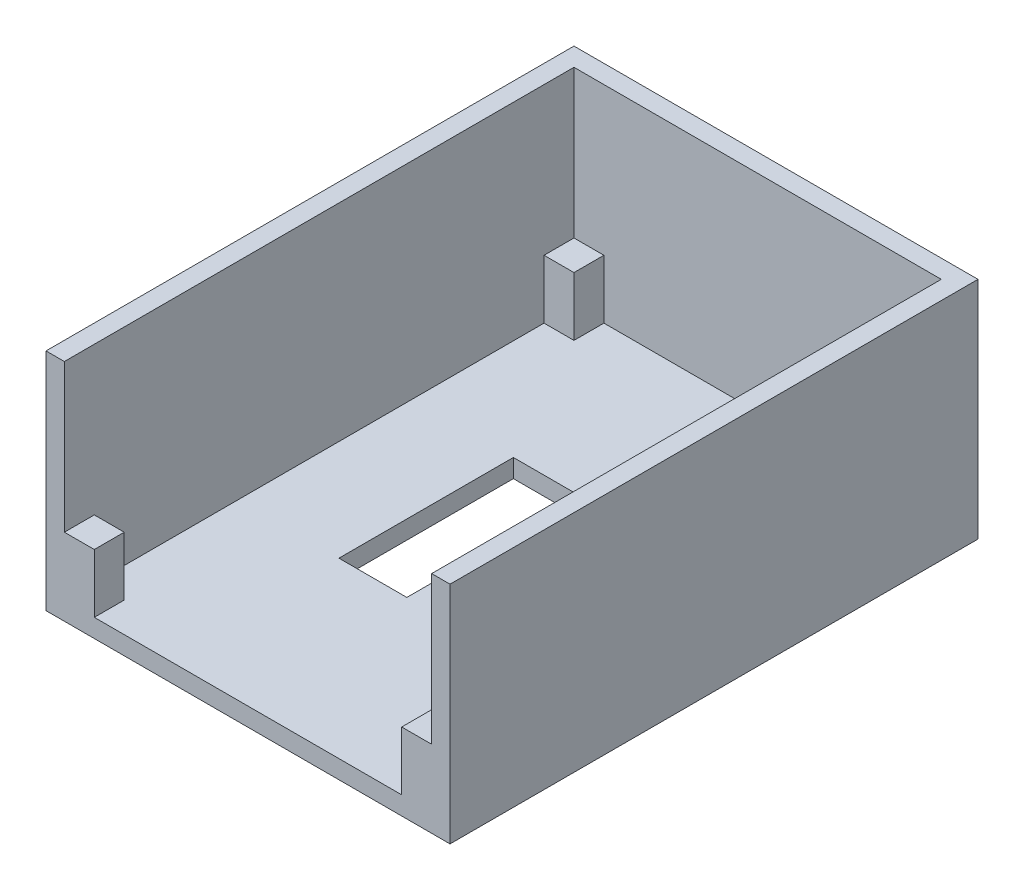
ISO-10303-21;
HEADER;
FILE_DESCRIPTION(('STEP AP214'),'2;1');
FILE_NAME('part.step','',(''),(''),'','','');
FILE_SCHEMA(('AUTOMOTIVE_DESIGN { 1 0 10303 214 1 1 1 1 }'));
ENDSEC;
DATA;
#1=APPLICATION_CONTEXT('core data for automotive mechanical design processes');
#2=APPLICATION_PROTOCOL_DEFINITION('international standard','automotive_design',2000,#1);
#3=PRODUCT_CONTEXT('',#1,'mechanical');
#4=PRODUCT('Part','Part','',(#3));
#5=PRODUCT_RELATED_PRODUCT_CATEGORY('part','',(#4));
#6=PRODUCT_DEFINITION_FORMATION('','',#4);
#7=PRODUCT_DEFINITION_CONTEXT('part definition',#1,'design');
#8=PRODUCT_DEFINITION('design','',#6,#7);
#9=PRODUCT_DEFINITION_SHAPE('','',#8);
#10=(LENGTH_UNIT() NAMED_UNIT(*) SI_UNIT(.MILLI.,.METRE.));
#11=(NAMED_UNIT(*) PLANE_ANGLE_UNIT() SI_UNIT($,.RADIAN.));
#12=(NAMED_UNIT(*) SI_UNIT($,.STERADIAN.) SOLID_ANGLE_UNIT());
#13=UNCERTAINTY_MEASURE_WITH_UNIT(LENGTH_MEASURE(1.E-05),#10,'distance_accuracy_value','');
#14=(GEOMETRIC_REPRESENTATION_CONTEXT(3) GLOBAL_UNCERTAINTY_ASSIGNED_CONTEXT((#13)) GLOBAL_UNIT_ASSIGNED_CONTEXT((#10,
#11,#12)) REPRESENTATION_CONTEXT('',''));
#15=CARTESIAN_POINT('',(0.,0.,0.));
#16=DIRECTION('',(0.,0.,1.));
#17=DIRECTION('',(1.,0.,0.));
#18=AXIS2_PLACEMENT_3D('',#15,#16,#17);
#19=CARTESIAN_POINT('',(0.,2.54,0.));
#20=DIRECTION('',(0.,1.,0.));
#21=DIRECTION('',(0.,0.,1.));
#22=AXIS2_PLACEMENT_3D('',#19,#20,#21);
#23=PLANE('',#22);
#24=DIRECTION('',(0.,0.,1.));
#25=VECTOR('',#24,1.);
#26=CARTESIAN_POINT('',(-11.43,2.54,-12.8905));
#27=LINE('',#26,#25);
#28=CARTESIAN_POINT('',(-11.43,2.54,-12.8905));
#29=VERTEX_POINT('',#28);
#30=CARTESIAN_POINT('',(-11.43,2.54,11.2395));
#31=VERTEX_POINT('',#30);
#32=EDGE_CURVE('E56',#29,#31,#27,.T.);
#33=ORIENTED_EDGE('',*,*,#32,.F.);
#34=DIRECTION('',(-1.,0.,0.));
#35=VECTOR('',#34,1.);
#36=CARTESIAN_POINT('',(-11.43,2.54,-12.8905));
#37=LINE('',#36,#35);
#38=CARTESIAN_POINT('',(-2.032,2.54,-12.8905));
#39=VERTEX_POINT('',#38);
#40=EDGE_CURVE('E222',#39,#29,#37,.T.);
#41=ORIENTED_EDGE('',*,*,#40,.F.);
#42=DIRECTION('',(0.,0.,-1.));
#43=VECTOR('',#42,1.);
#44=CARTESIAN_POINT('',(-2.032,2.54,-12.8905));
#45=LINE('',#44,#43);
#46=CARTESIAN_POINT('',(-2.032,2.54,11.2395));
#47=VERTEX_POINT('',#46);
#48=EDGE_CURVE('E226',#47,#39,#45,.T.);
#49=ORIENTED_EDGE('',*,*,#48,.F.);
#50=DIRECTION('',(1.,0.,0.));
#51=VECTOR('',#50,1.);
#52=CARTESIAN_POINT('',(-11.43,2.54,11.2395));
#53=LINE('',#52,#51);
#54=EDGE_CURVE('E235',#31,#47,#53,.T.);
#55=ORIENTED_EDGE('',*,*,#54,.F.);
#56=EDGE_LOOP('',(#33,#41,#49,#55));
#57=FACE_BOUND('',#56,.T.);
#58=DIRECTION('',(-1.,0.,0.));
#59=VECTOR('',#58,1.);
#60=CARTESIAN_POINT('',(-25.4,2.54,31.1023));
#61=LINE('',#60,#59);
#62=CARTESIAN_POINT('',(-21.2598,2.54,31.1023));
#63=VERTEX_POINT('',#62);
#64=CARTESIAN_POINT('',(-25.4,2.54,31.1023));
#65=VERTEX_POINT('',#64);
#66=EDGE_CURVE('E255',#63,#65,#61,.T.);
#67=ORIENTED_EDGE('',*,*,#66,.F.);
#68=DIRECTION('',(0.,0.,-1.));
#69=VECTOR('',#68,1.);
#70=CARTESIAN_POINT('',(-21.2598,2.54,35.2425));
#71=LINE('',#70,#69);
#72=CARTESIAN_POINT('',(-21.2598,2.54,35.2425));
#73=VERTEX_POINT('',#72);
#74=EDGE_CURVE('E244',#73,#63,#71,.T.);
#75=ORIENTED_EDGE('',*,*,#74,.F.);
#76=DIRECTION('',(1.,0.,0.));
#77=VECTOR('',#76,1.);
#78=CARTESIAN_POINT('',(25.4,2.54,35.2425));
#79=LINE('',#78,#77);
#80=CARTESIAN_POINT('',(21.2598,2.54,35.2425));
#81=VERTEX_POINT('',#80);
#82=EDGE_CURVE('E452',#73,#81,#79,.T.);
#83=ORIENTED_EDGE('',*,*,#82,.T.);
#84=DIRECTION('',(0.,0.,1.));
#85=VECTOR('',#84,1.);
#86=CARTESIAN_POINT('',(21.2598,2.54,35.2425));
#87=LINE('',#86,#85);
#88=CARTESIAN_POINT('',(21.2598,2.54,31.1023));
#89=VERTEX_POINT('',#88);
#90=EDGE_CURVE('E288',#89,#81,#87,.T.);
#91=ORIENTED_EDGE('',*,*,#90,.F.);
#92=DIRECTION('',(-1.,0.,0.));
#93=VECTOR('',#92,1.);
#94=CARTESIAN_POINT('',(25.4,2.54,31.1023));
#95=LINE('',#94,#93);
#96=CARTESIAN_POINT('',(25.4,2.54,31.1023));
#97=VERTEX_POINT('',#96);
#98=EDGE_CURVE('E282',#97,#89,#95,.T.);
#99=ORIENTED_EDGE('',*,*,#98,.F.);
#100=DIRECTION('',(0.,0.,-1.));
#101=VECTOR('',#100,1.);
#102=CARTESIAN_POINT('',(25.4,2.54,35.2425));
#103=LINE('',#102,#101);
#104=CARTESIAN_POINT('',(25.4,2.54,-31.1023));
#105=VERTEX_POINT('',#104);
#106=EDGE_CURVE('E49',#97,#105,#103,.T.);
#107=ORIENTED_EDGE('',*,*,#106,.T.);
#108=DIRECTION('',(1.,0.,0.));
#109=VECTOR('',#108,1.);
#110=CARTESIAN_POINT('',(25.4,2.54,-31.1023));
#111=LINE('',#110,#109);
#112=CARTESIAN_POINT('',(21.2598,2.54,-31.1023));
#113=VERTEX_POINT('',#112);
#114=EDGE_CURVE('E322',#113,#105,#111,.T.);
#115=ORIENTED_EDGE('',*,*,#114,.F.);
#116=DIRECTION('',(0.,0.,1.));
#117=VECTOR('',#116,1.);
#118=CARTESIAN_POINT('',(21.2598,2.54,-35.2425));
#119=LINE('',#118,#117);
#120=CARTESIAN_POINT('',(21.2598,2.54,-35.2425));
#121=VERTEX_POINT('',#120);
#122=EDGE_CURVE('E316',#121,#113,#119,.T.);
#123=ORIENTED_EDGE('',*,*,#122,.F.);
#124=DIRECTION('',(-1.,0.,0.));
#125=VECTOR('',#124,1.);
#126=CARTESIAN_POINT('',(25.4,2.54,-35.2425));
#127=LINE('',#126,#125);
#128=CARTESIAN_POINT('',(-21.2598,2.54,-35.2425));
#129=VERTEX_POINT('',#128);
#130=EDGE_CURVE('E11',#121,#129,#127,.T.);
#131=ORIENTED_EDGE('',*,*,#130,.T.);
#132=DIRECTION('',(0.,0.,-1.));
#133=VECTOR('',#132,1.);
#134=CARTESIAN_POINT('',(-21.2598,2.54,-35.2425));
#135=LINE('',#134,#133);
#136=CARTESIAN_POINT('',(-21.2598,2.54,-31.1023));
#137=VERTEX_POINT('',#136);
#138=EDGE_CURVE('E357',#137,#129,#135,.T.);
#139=ORIENTED_EDGE('',*,*,#138,.F.);
#140=DIRECTION('',(1.,0.,0.));
#141=VECTOR('',#140,1.);
#142=CARTESIAN_POINT('',(-25.4,2.54,-31.1023));
#143=LINE('',#142,#141);
#144=CARTESIAN_POINT('',(-25.4,2.54,-31.1023));
#145=VERTEX_POINT('',#144);
#146=EDGE_CURVE('E351',#145,#137,#143,.T.);
#147=ORIENTED_EDGE('',*,*,#146,.F.);
#148=DIRECTION('',(0.,0.,1.));
#149=VECTOR('',#148,1.);
#150=CARTESIAN_POINT('',(-25.4,2.54,35.2425));
#151=LINE('',#150,#149);
#152=EDGE_CURVE('E448',#145,#65,#151,.T.);
#153=ORIENTED_EDGE('',*,*,#152,.T.);
#154=EDGE_LOOP('',(#67,#75,#83,#91,#99,#107,#115,#123,#131,#139,#147,#153));
#155=FACE_BOUND('',#154,.T.);
#156=ADVANCED_FACE('F39',(#57,#155),#23,.T.);
#157=CARTESIAN_POINT('',(-25.4,31.115,35.2425));
#158=DIRECTION('',(-1.,0.,0.));
#159=DIRECTION('',(0.,0.,1.));
#160=AXIS2_PLACEMENT_3D('',#157,#158,#159);
#161=PLANE('',#160);
#162=DIRECTION('',(0.,-1.,0.));
#163=VECTOR('',#162,1.);
#164=CARTESIAN_POINT('',(-25.4,10.668,31.1023));
#165=LINE('',#164,#163);
#166=CARTESIAN_POINT('',(-25.4,10.668,31.1023));
#167=VERTEX_POINT('',#166);
#168=EDGE_CURVE('E265',#167,#65,#165,.T.);
#169=ORIENTED_EDGE('',*,*,#168,.T.);
#170=ORIENTED_EDGE('',*,*,#152,.F.);
#171=DIRECTION('',(0.,-1.,0.));
#172=VECTOR('',#171,1.);
#173=CARTESIAN_POINT('',(-25.4,10.668,-31.1023));
#174=LINE('',#173,#172);
#175=CARTESIAN_POINT('',(-25.4,10.668,-31.1023));
#176=VERTEX_POINT('',#175);
#177=EDGE_CURVE('E380',#176,#145,#174,.T.);
#178=ORIENTED_EDGE('',*,*,#177,.F.);
#179=DIRECTION('',(0.,0.,1.));
#180=VECTOR('',#179,1.);
#181=CARTESIAN_POINT('',(-25.4,10.668,-35.2425));
#182=LINE('',#181,#180);
#183=CARTESIAN_POINT('',(-25.4,10.668,-35.2425));
#184=VERTEX_POINT('',#183);
#185=EDGE_CURVE('E352',#184,#176,#182,.T.);
#186=ORIENTED_EDGE('',*,*,#185,.F.);
#187=DIRECTION('',(0.,-1.,0.));
#188=VECTOR('',#187,1.);
#189=CARTESIAN_POINT('',(-25.4,31.115,-35.2425));
#190=LINE('',#189,#188);
#191=CARTESIAN_POINT('',(-25.4,31.115,-35.2425));
#192=VERTEX_POINT('',#191);
#193=EDGE_CURVE('E437',#192,#184,#190,.T.);
#194=ORIENTED_EDGE('',*,*,#193,.F.);
#195=DIRECTION('',(0.,0.,-1.));
#196=VECTOR('',#195,1.);
#197=CARTESIAN_POINT('',(-25.4,31.115,35.2425));
#198=LINE('',#197,#196);
#199=CARTESIAN_POINT('',(-25.4,31.115,35.2425));
#200=VERTEX_POINT('',#199);
#201=EDGE_CURVE('E392',#200,#192,#198,.T.);
#202=ORIENTED_EDGE('',*,*,#201,.F.);
#203=DIRECTION('',(0.,-1.,0.));
#204=VECTOR('',#203,1.);
#205=CARTESIAN_POINT('',(-25.4,31.115,35.2425));
#206=LINE('',#205,#204);
#207=CARTESIAN_POINT('',(-25.4,10.668,35.2425));
#208=VERTEX_POINT('',#207);
#209=EDGE_CURVE('E441',#200,#208,#206,.T.);
#210=ORIENTED_EDGE('',*,*,#209,.T.);
#211=DIRECTION('',(0.,0.,1.));
#212=VECTOR('',#211,1.);
#213=CARTESIAN_POINT('',(-25.4,10.668,35.2425));
#214=LINE('',#213,#212);
#215=EDGE_CURVE('E250',#167,#208,#214,.T.);
#216=ORIENTED_EDGE('',*,*,#215,.F.);
#217=EDGE_LOOP('',(#169,#170,#178,#186,#194,#202,#210,#216));
#218=FACE_BOUND('',#217,.T.);
#219=ADVANCED_FACE('F487',(#218),#161,.F.);
#220=CARTESIAN_POINT('',(25.4,31.115,35.2425));
#221=DIRECTION('',(1.,0.,0.));
#222=DIRECTION('',(0.,0.,-1.));
#223=AXIS2_PLACEMENT_3D('',#220,#221,#222);
#224=PLANE('',#223);
#225=DIRECTION('',(0.,-1.,0.));
#226=VECTOR('',#225,1.);
#227=CARTESIAN_POINT('',(25.4,10.668,31.1023));
#228=LINE('',#227,#226);
#229=CARTESIAN_POINT('',(25.4,10.668,31.1023));
#230=VERTEX_POINT('',#229);
#231=EDGE_CURVE('E312',#230,#97,#228,.T.);
#232=ORIENTED_EDGE('',*,*,#231,.F.);
#233=DIRECTION('',(0.,0.,-1.));
#234=VECTOR('',#233,1.);
#235=CARTESIAN_POINT('',(25.4,10.668,35.2425));
#236=LINE('',#235,#234);
#237=CARTESIAN_POINT('',(25.4,10.668,35.2425));
#238=VERTEX_POINT('',#237);
#239=EDGE_CURVE('E283',#238,#230,#236,.T.);
#240=ORIENTED_EDGE('',*,*,#239,.F.);
#241=DIRECTION('',(0.,-1.,0.));
#242=VECTOR('',#241,1.);
#243=CARTESIAN_POINT('',(25.4,31.115,35.2425));
#244=LINE('',#243,#242);
#245=CARTESIAN_POINT('',(25.4,31.115,35.2425));
#246=VERTEX_POINT('',#245);
#247=EDGE_CURVE('E430',#246,#238,#244,.T.);
#248=ORIENTED_EDGE('',*,*,#247,.F.);
#249=DIRECTION('',(0.,0.,1.));
#250=VECTOR('',#249,1.);
#251=CARTESIAN_POINT('',(25.4,31.115,35.2425));
#252=LINE('',#251,#250);
#253=CARTESIAN_POINT('',(25.4,31.115,-35.2425));
#254=VERTEX_POINT('',#253);
#255=EDGE_CURVE('E398',#254,#246,#252,.T.);
#256=ORIENTED_EDGE('',*,*,#255,.F.);
#257=DIRECTION('',(0.,-1.,0.));
#258=VECTOR('',#257,1.);
#259=CARTESIAN_POINT('',(25.4,31.115,-35.2425));
#260=LINE('',#259,#258);
#261=CARTESIAN_POINT('',(25.4,10.668,-35.2425));
#262=VERTEX_POINT('',#261);
#263=EDGE_CURVE('E434',#254,#262,#260,.T.);
#264=ORIENTED_EDGE('',*,*,#263,.T.);
#265=DIRECTION('',(0.,0.,-1.));
#266=VECTOR('',#265,1.);
#267=CARTESIAN_POINT('',(25.4,10.668,-35.2425));
#268=LINE('',#267,#266);
#269=CARTESIAN_POINT('',(25.4,10.668,-31.1023));
#270=VERTEX_POINT('',#269);
#271=EDGE_CURVE('E317',#270,#262,#268,.T.);
#272=ORIENTED_EDGE('',*,*,#271,.F.);
#273=DIRECTION('',(0.,-1.,0.));
#274=VECTOR('',#273,1.);
#275=CARTESIAN_POINT('',(25.4,10.668,-31.1023));
#276=LINE('',#275,#274);
#277=EDGE_CURVE('E333',#270,#105,#276,.T.);
#278=ORIENTED_EDGE('',*,*,#277,.T.);
#279=ORIENTED_EDGE('',*,*,#106,.F.);
#280=EDGE_LOOP('',(#232,#240,#248,#256,#264,#272,#278,#279));
#281=FACE_BOUND('',#280,.T.);
#282=ADVANCED_FACE('F460',(#281),#224,.F.);
#283=CARTESIAN_POINT('',(25.4,31.115,-35.2425));
#284=DIRECTION('',(0.,0.,-1.));
#285=DIRECTION('',(-1.,0.,0.));
#286=AXIS2_PLACEMENT_3D('',#283,#284,#285);
#287=PLANE('',#286);
#288=DIRECTION('',(0.,-1.,0.));
#289=VECTOR('',#288,1.);
#290=CARTESIAN_POINT('',(21.2598,10.668,-35.2425));
#291=LINE('',#290,#289);
#292=CARTESIAN_POINT('',(21.2598,10.668,-35.2425));
#293=VERTEX_POINT('',#292);
#294=EDGE_CURVE('E347',#293,#121,#291,.T.);
#295=ORIENTED_EDGE('',*,*,#294,.F.);
#296=DIRECTION('',(-1.,0.,0.));
#297=VECTOR('',#296,1.);
#298=CARTESIAN_POINT('',(25.4,10.668,-35.2425));
#299=LINE('',#298,#297);
#300=EDGE_CURVE('E321',#262,#293,#299,.T.);
#301=ORIENTED_EDGE('',*,*,#300,.F.);
#302=ORIENTED_EDGE('',*,*,#263,.F.);
#303=DIRECTION('',(1.,0.,0.));
#304=VECTOR('',#303,1.);
#305=CARTESIAN_POINT('',(25.4,31.115,-35.2425));
#306=LINE('',#305,#304);
#307=EDGE_CURVE('E395',#192,#254,#306,.T.);
#308=ORIENTED_EDGE('',*,*,#307,.F.);
#309=ORIENTED_EDGE('',*,*,#193,.T.);
#310=DIRECTION('',(-1.,0.,0.));
#311=VECTOR('',#310,1.);
#312=CARTESIAN_POINT('',(-25.4,10.668,-35.2425));
#313=LINE('',#312,#311);
#314=CARTESIAN_POINT('',(-21.2598,10.668,-35.2425));
#315=VERTEX_POINT('',#314);
#316=EDGE_CURVE('E364',#315,#184,#313,.T.);
#317=ORIENTED_EDGE('',*,*,#316,.F.);
#318=DIRECTION('',(0.,-1.,0.));
#319=VECTOR('',#318,1.);
#320=CARTESIAN_POINT('',(-21.2598,10.668,-35.2425));
#321=LINE('',#320,#319);
#322=EDGE_CURVE('E367',#315,#129,#321,.T.);
#323=ORIENTED_EDGE('',*,*,#322,.T.);
#324=ORIENTED_EDGE('',*,*,#130,.F.);
#325=EDGE_LOOP('',(#295,#301,#302,#308,#309,#317,#323,#324));
#326=FACE_BOUND('',#325,.T.);
#327=ADVANCED_FACE('F471',(#326),#287,.F.);
#328=CARTESIAN_POINT('',(25.4,2.54,35.2425));
#329=DIRECTION('',(0.,0.,-1.));
#330=DIRECTION('',(-1.,0.,0.));
#331=AXIS2_PLACEMENT_3D('',#328,#329,#330);
#332=PLANE('',#331);
#333=DIRECTION('',(1.,0.,0.));
#334=VECTOR('',#333,1.);
#335=CARTESIAN_POINT('',(25.4,0.,35.2425));
#336=LINE('',#335,#334);
#337=CARTESIAN_POINT('',(-27.94,0.,35.2425));
#338=VERTEX_POINT('',#337);
#339=CARTESIAN_POINT('',(27.94,0.,35.2425));
#340=VERTEX_POINT('',#339);
#341=EDGE_CURVE('E43',#338,#340,#336,.T.);
#342=ORIENTED_EDGE('',*,*,#341,.T.);
#343=DIRECTION('',(0.,-1.,0.));
#344=VECTOR('',#343,1.);
#345=CARTESIAN_POINT('',(27.94,31.115,35.2425));
#346=LINE('',#345,#344);
#347=CARTESIAN_POINT('',(27.94,31.115,35.2425));
#348=VERTEX_POINT('',#347);
#349=EDGE_CURVE('E426',#348,#340,#346,.T.);
#350=ORIENTED_EDGE('',*,*,#349,.F.);
#351=DIRECTION('',(1.,0.,0.));
#352=VECTOR('',#351,1.);
#353=CARTESIAN_POINT('',(25.4,31.115,35.2425));
#354=LINE('',#353,#352);
#355=EDGE_CURVE('E401',#246,#348,#354,.T.);
#356=ORIENTED_EDGE('',*,*,#355,.F.);
#357=ORIENTED_EDGE('',*,*,#247,.T.);
#358=DIRECTION('',(1.,0.,0.));
#359=VECTOR('',#358,1.);
#360=CARTESIAN_POINT('',(25.4,10.668,35.2425));
#361=LINE('',#360,#359);
#362=CARTESIAN_POINT('',(21.2598,10.668,35.2425));
#363=VERTEX_POINT('',#362);
#364=EDGE_CURVE('E294',#363,#238,#361,.T.);
#365=ORIENTED_EDGE('',*,*,#364,.F.);
#366=DIRECTION('',(0.,-1.,0.));
#367=VECTOR('',#366,1.);
#368=CARTESIAN_POINT('',(21.2598,10.668,35.2425));
#369=LINE('',#368,#367);
#370=EDGE_CURVE('E298',#363,#81,#369,.T.);
#371=ORIENTED_EDGE('',*,*,#370,.T.);
#372=ORIENTED_EDGE('',*,*,#82,.F.);
#373=DIRECTION('',(0.,-1.,0.));
#374=VECTOR('',#373,1.);
#375=CARTESIAN_POINT('',(-21.2598,10.668,35.2425));
#376=LINE('',#375,#374);
#377=CARTESIAN_POINT('',(-21.2598,10.668,35.2425));
#378=VERTEX_POINT('',#377);
#379=EDGE_CURVE('E278',#378,#73,#376,.T.);
#380=ORIENTED_EDGE('',*,*,#379,.F.);
#381=DIRECTION('',(1.,0.,0.));
#382=VECTOR('',#381,1.);
#383=CARTESIAN_POINT('',(-25.4,10.668,35.2425));
#384=LINE('',#383,#382);
#385=EDGE_CURVE('E254',#208,#378,#384,.T.);
#386=ORIENTED_EDGE('',*,*,#385,.F.);
#387=ORIENTED_EDGE('',*,*,#209,.F.);
#388=DIRECTION('',(1.,0.,0.));
#389=VECTOR('',#388,1.);
#390=CARTESIAN_POINT('',(-27.94,31.115,35.2425));
#391=LINE('',#390,#389);
#392=CARTESIAN_POINT('',(-27.94,31.115,35.2425));
#393=VERTEX_POINT('',#392);
#394=EDGE_CURVE('E388',#393,#200,#391,.T.);
#395=ORIENTED_EDGE('',*,*,#394,.F.);
#396=DIRECTION('',(0.,-1.,0.));
#397=VECTOR('',#396,1.);
#398=CARTESIAN_POINT('',(-27.94,31.115,35.2425));
#399=LINE('',#398,#397);
#400=EDGE_CURVE('E444',#393,#338,#399,.T.);
#401=ORIENTED_EDGE('',*,*,#400,.T.);
#402=EDGE_LOOP('',(#342,#350,#356,#357,#365,#371,#372,#380,#386,#387,#395,#401));
#403=FACE_BOUND('',#402,.T.);
#404=ADVANCED_FACE('F41',(#403),#332,.F.);
#405=CARTESIAN_POINT('',(0.,0.,0.));
#406=DIRECTION('',(0.,1.,0.));
#407=DIRECTION('',(0.,0.,1.));
#408=AXIS2_PLACEMENT_3D('',#405,#406,#407);
#409=PLANE('',#408);
#410=DIRECTION('',(-1.,0.,0.));
#411=VECTOR('',#410,1.);
#412=CARTESIAN_POINT('',(-11.43,0.,-12.8905));
#413=LINE('',#412,#411);
#414=CARTESIAN_POINT('',(-2.032,0.,-12.8905));
#415=VERTEX_POINT('',#414);
#416=CARTESIAN_POINT('',(-11.43,0.,-12.8905));
#417=VERTEX_POINT('',#416);
#418=EDGE_CURVE('E210',#415,#417,#413,.T.);
#419=ORIENTED_EDGE('',*,*,#418,.T.);
#420=DIRECTION('',(0.,0.,1.));
#421=VECTOR('',#420,1.);
#422=CARTESIAN_POINT('',(-11.43,0.,-12.8905));
#423=LINE('',#422,#421);
#424=CARTESIAN_POINT('',(-11.43,0.,11.2395));
#425=VERTEX_POINT('',#424);
#426=EDGE_CURVE('E203',#417,#425,#423,.T.);
#427=ORIENTED_EDGE('',*,*,#426,.T.);
#428=DIRECTION('',(1.,0.,0.));
#429=VECTOR('',#428,1.);
#430=CARTESIAN_POINT('',(-11.43,0.,11.2395));
#431=LINE('',#430,#429);
#432=CARTESIAN_POINT('',(-2.032,0.,11.2395));
#433=VERTEX_POINT('',#432);
#434=EDGE_CURVE('E213',#425,#433,#431,.T.);
#435=ORIENTED_EDGE('',*,*,#434,.T.);
#436=DIRECTION('',(0.,0.,-1.));
#437=VECTOR('',#436,1.);
#438=CARTESIAN_POINT('',(-2.032,0.,-12.8905));
#439=LINE('',#438,#437);
#440=EDGE_CURVE('E64',#433,#415,#439,.T.);
#441=ORIENTED_EDGE('',*,*,#440,.T.);
#442=EDGE_LOOP('',(#419,#427,#435,#441));
#443=FACE_BOUND('',#442,.T.);
#444=ORIENTED_EDGE('',*,*,#341,.F.);
#445=DIRECTION('',(0.,0.,1.));
#446=VECTOR('',#445,1.);
#447=CARTESIAN_POINT('',(-27.94,0.,35.2425));
#448=LINE('',#447,#446);
#449=CARTESIAN_POINT('',(-27.94,0.,-37.7825));
#450=VERTEX_POINT('',#449);
#451=EDGE_CURVE('E383',#450,#338,#448,.T.);
#452=ORIENTED_EDGE('',*,*,#451,.F.);
#453=DIRECTION('',(-1.,0.,0.));
#454=VECTOR('',#453,1.);
#455=CARTESIAN_POINT('',(27.94,0.,-37.7825));
#456=LINE('',#455,#454);
#457=CARTESIAN_POINT('',(27.94,0.,-37.7825));
#458=VERTEX_POINT('',#457);
#459=EDGE_CURVE('E389',#458,#450,#456,.T.);
#460=ORIENTED_EDGE('',*,*,#459,.F.);
#461=DIRECTION('',(0.,0.,-1.));
#462=VECTOR('',#461,1.);
#463=CARTESIAN_POINT('',(27.94,0.,35.2425));
#464=LINE('',#463,#462);
#465=EDGE_CURVE('E414',#340,#458,#464,.T.);
#466=ORIENTED_EDGE('',*,*,#465,.F.);
#467=EDGE_LOOP('',(#444,#452,#460,#466));
#468=FACE_BOUND('',#467,.T.);
#469=ADVANCED_FACE('F218',(#443,#468),#409,.F.);
#470=CARTESIAN_POINT('',(-27.94,31.115,35.2425));
#471=DIRECTION('',(1.,0.,0.));
#472=DIRECTION('',(0.,0.,-1.));
#473=AXIS2_PLACEMENT_3D('',#470,#471,#472);
#474=PLANE('',#473);
#475=ORIENTED_EDGE('',*,*,#451,.T.);
#476=ORIENTED_EDGE('',*,*,#400,.F.);
#477=DIRECTION('',(0.,0.,1.));
#478=VECTOR('',#477,1.);
#479=CARTESIAN_POINT('',(-27.94,31.115,35.2425));
#480=LINE('',#479,#478);
#481=CARTESIAN_POINT('',(-27.94,31.115,-37.7825));
#482=VERTEX_POINT('',#481);
#483=EDGE_CURVE('E384',#482,#393,#480,.T.);
#484=ORIENTED_EDGE('',*,*,#483,.F.);
#485=DIRECTION('',(0.,-1.,0.));
#486=VECTOR('',#485,1.);
#487=CARTESIAN_POINT('',(-27.94,31.115,-37.7825));
#488=LINE('',#487,#486);
#489=EDGE_CURVE('E410',#482,#450,#488,.T.);
#490=ORIENTED_EDGE('',*,*,#489,.T.);
#491=EDGE_LOOP('',(#475,#476,#484,#490));
#492=FACE_BOUND('',#491,.T.);
#493=ADVANCED_FACE('F532',(#492),#474,.F.);
#494=CARTESIAN_POINT('',(27.94,31.115,35.2425));
#495=DIRECTION('',(-1.,0.,0.));
#496=DIRECTION('',(0.,0.,1.));
#497=AXIS2_PLACEMENT_3D('',#494,#495,#496);
#498=PLANE('',#497);
#499=ORIENTED_EDGE('',*,*,#465,.T.);
#500=DIRECTION('',(0.,-1.,0.));
#501=VECTOR('',#500,1.);
#502=CARTESIAN_POINT('',(27.94,31.115,-37.7825));
#503=LINE('',#502,#501);
#504=CARTESIAN_POINT('',(27.94,31.115,-37.7825));
#505=VERTEX_POINT('',#504);
#506=EDGE_CURVE('E422',#505,#458,#503,.T.);
#507=ORIENTED_EDGE('',*,*,#506,.F.);
#508=DIRECTION('',(0.,0.,-1.));
#509=VECTOR('',#508,1.);
#510=CARTESIAN_POINT('',(27.94,31.115,35.2425));
#511=LINE('',#510,#509);
#512=EDGE_CURVE('E404',#348,#505,#511,.T.);
#513=ORIENTED_EDGE('',*,*,#512,.F.);
#514=ORIENTED_EDGE('',*,*,#349,.T.);
#515=EDGE_LOOP('',(#499,#507,#513,#514));
#516=FACE_BOUND('',#515,.T.);
#517=ADVANCED_FACE('F538',(#516),#498,.F.);
#518=CARTESIAN_POINT('',(27.94,31.115,-37.7825));
#519=DIRECTION('',(0.,0.,1.));
#520=DIRECTION('',(1.,0.,0.));
#521=AXIS2_PLACEMENT_3D('',#518,#519,#520);
#522=PLANE('',#521);
#523=ORIENTED_EDGE('',*,*,#459,.T.);
#524=ORIENTED_EDGE('',*,*,#489,.F.);
#525=DIRECTION('',(-1.,0.,0.));
#526=VECTOR('',#525,1.);
#527=CARTESIAN_POINT('',(27.94,31.115,-37.7825));
#528=LINE('',#527,#526);
#529=EDGE_CURVE('E407',#505,#482,#528,.T.);
#530=ORIENTED_EDGE('',*,*,#529,.F.);
#531=ORIENTED_EDGE('',*,*,#506,.T.);
#532=EDGE_LOOP('',(#523,#524,#530,#531));
#533=FACE_BOUND('',#532,.T.);
#534=ADVANCED_FACE('F551',(#533),#522,.F.);
#535=CARTESIAN_POINT('',(0.,31.115,0.));
#536=DIRECTION('',(0.,1.,0.));
#537=DIRECTION('',(0.,0.,1.));
#538=AXIS2_PLACEMENT_3D('',#535,#536,#537);
#539=PLANE('',#538);
#540=ORIENTED_EDGE('',*,*,#483,.T.);
#541=ORIENTED_EDGE('',*,*,#394,.T.);
#542=ORIENTED_EDGE('',*,*,#201,.T.);
#543=ORIENTED_EDGE('',*,*,#307,.T.);
#544=ORIENTED_EDGE('',*,*,#255,.T.);
#545=ORIENTED_EDGE('',*,*,#355,.T.);
#546=ORIENTED_EDGE('',*,*,#512,.T.);
#547=ORIENTED_EDGE('',*,*,#529,.T.);
#548=EDGE_LOOP('',(#540,#541,#542,#543,#544,#545,#546,#547));
#549=FACE_BOUND('',#548,.T.);
#550=ADVANCED_FACE('F555',(#549),#539,.T.);
#551=CARTESIAN_POINT('',(-25.4,10.668,-31.1023));
#552=DIRECTION('',(0.,0.,-1.));
#553=DIRECTION('',(-1.,0.,0.));
#554=AXIS2_PLACEMENT_3D('',#551,#552,#553);
#555=PLANE('',#554);
#556=ORIENTED_EDGE('',*,*,#146,.T.);
#557=DIRECTION('',(0.,-1.,0.));
#558=VECTOR('',#557,1.);
#559=CARTESIAN_POINT('',(-21.2598,10.668,-31.1023));
#560=LINE('',#559,#558);
#561=CARTESIAN_POINT('',(-21.2598,10.668,-31.1023));
#562=VERTEX_POINT('',#561);
#563=EDGE_CURVE('E376',#562,#137,#560,.T.);
#564=ORIENTED_EDGE('',*,*,#563,.F.);
#565=DIRECTION('',(1.,0.,0.));
#566=VECTOR('',#565,1.);
#567=CARTESIAN_POINT('',(-25.4,10.668,-31.1023));
#568=LINE('',#567,#566);
#569=EDGE_CURVE('E356',#176,#562,#568,.T.);
#570=ORIENTED_EDGE('',*,*,#569,.F.);
#571=ORIENTED_EDGE('',*,*,#177,.T.);
#572=EDGE_LOOP('',(#556,#564,#570,#571));
#573=FACE_BOUND('',#572,.T.);
#574=ADVANCED_FACE('F483',(#573),#555,.F.);
#575=CARTESIAN_POINT('',(-21.2598,10.668,-35.2425));
#576=DIRECTION('',(-1.,0.,0.));
#577=DIRECTION('',(0.,0.,1.));
#578=AXIS2_PLACEMENT_3D('',#575,#576,#577);
#579=PLANE('',#578);
#580=ORIENTED_EDGE('',*,*,#138,.T.);
#581=ORIENTED_EDGE('',*,*,#322,.F.);
#582=DIRECTION('',(0.,0.,-1.));
#583=VECTOR('',#582,1.);
#584=CARTESIAN_POINT('',(-21.2598,10.668,-35.2425));
#585=LINE('',#584,#583);
#586=EDGE_CURVE('E360',#562,#315,#585,.T.);
#587=ORIENTED_EDGE('',*,*,#586,.F.);
#588=ORIENTED_EDGE('',*,*,#563,.T.);
#589=EDGE_LOOP('',(#580,#581,#587,#588));
#590=FACE_BOUND('',#589,.T.);
#591=ADVANCED_FACE('F476',(#590),#579,.F.);
#592=CARTESIAN_POINT('',(0.,10.668,0.));
#593=DIRECTION('',(0.,1.,0.));
#594=DIRECTION('',(0.,0.,1.));
#595=AXIS2_PLACEMENT_3D('',#592,#593,#594);
#596=PLANE('',#595);
#597=ORIENTED_EDGE('',*,*,#185,.T.);
#598=ORIENTED_EDGE('',*,*,#569,.T.);
#599=ORIENTED_EDGE('',*,*,#586,.T.);
#600=ORIENTED_EDGE('',*,*,#316,.T.);
#601=EDGE_LOOP('',(#597,#598,#599,#600));
#602=FACE_BOUND('',#601,.T.);
#603=ADVANCED_FACE('F478',(#602),#596,.T.);
#604=CARTESIAN_POINT('',(21.2598,10.668,-35.2425));
#605=DIRECTION('',(1.,0.,0.));
#606=DIRECTION('',(0.,0.,-1.));
#607=AXIS2_PLACEMENT_3D('',#604,#605,#606);
#608=PLANE('',#607);
#609=ORIENTED_EDGE('',*,*,#122,.T.);
#610=DIRECTION('',(0.,-1.,0.));
#611=VECTOR('',#610,1.);
#612=CARTESIAN_POINT('',(21.2598,10.668,-31.1023));
#613=LINE('',#612,#611);
#614=CARTESIAN_POINT('',(21.2598,10.668,-31.1023));
#615=VERTEX_POINT('',#614);
#616=EDGE_CURVE('E343',#615,#113,#613,.T.);
#617=ORIENTED_EDGE('',*,*,#616,.F.);
#618=DIRECTION('',(0.,0.,1.));
#619=VECTOR('',#618,1.);
#620=CARTESIAN_POINT('',(21.2598,10.668,-35.2425));
#621=LINE('',#620,#619);
#622=EDGE_CURVE('E326',#293,#615,#621,.T.);
#623=ORIENTED_EDGE('',*,*,#622,.F.);
#624=ORIENTED_EDGE('',*,*,#294,.T.);
#625=EDGE_LOOP('',(#609,#617,#623,#624));
#626=FACE_BOUND('',#625,.T.);
#627=ADVANCED_FACE('F467',(#626),#608,.F.);
#628=CARTESIAN_POINT('',(25.4,10.668,-31.1023));
#629=DIRECTION('',(0.,0.,-1.));
#630=DIRECTION('',(-1.,0.,0.));
#631=AXIS2_PLACEMENT_3D('',#628,#629,#630);
#632=PLANE('',#631);
#633=ORIENTED_EDGE('',*,*,#114,.T.);
#634=ORIENTED_EDGE('',*,*,#277,.F.);
#635=DIRECTION('',(1.,0.,0.));
#636=VECTOR('',#635,1.);
#637=CARTESIAN_POINT('',(25.4,10.668,-31.1023));
#638=LINE('',#637,#636);
#639=EDGE_CURVE('E329',#615,#270,#638,.T.);
#640=ORIENTED_EDGE('',*,*,#639,.F.);
#641=ORIENTED_EDGE('',*,*,#616,.T.);
#642=EDGE_LOOP('',(#633,#634,#640,#641));
#643=FACE_BOUND('',#642,.T.);
#644=ADVANCED_FACE('F463',(#643),#632,.F.);
#645=CARTESIAN_POINT('',(0.,10.668,0.));
#646=DIRECTION('',(0.,-1.,0.));
#647=DIRECTION('',(0.,0.,-1.));
#648=AXIS2_PLACEMENT_3D('',#645,#646,#647);
#649=PLANE('',#648);
#650=ORIENTED_EDGE('',*,*,#271,.T.);
#651=ORIENTED_EDGE('',*,*,#300,.T.);
#652=ORIENTED_EDGE('',*,*,#622,.T.);
#653=ORIENTED_EDGE('',*,*,#639,.T.);
#654=EDGE_LOOP('',(#650,#651,#652,#653));
#655=FACE_BOUND('',#654,.T.);
#656=ADVANCED_FACE('F570',(#655),#649,.F.);
#657=CARTESIAN_POINT('',(25.4,10.668,31.1023));
#658=DIRECTION('',(0.,0.,1.));
#659=DIRECTION('',(1.,0.,0.));
#660=AXIS2_PLACEMENT_3D('',#657,#658,#659);
#661=PLANE('',#660);
#662=ORIENTED_EDGE('',*,*,#98,.T.);
#663=DIRECTION('',(0.,-1.,0.));
#664=VECTOR('',#663,1.);
#665=CARTESIAN_POINT('',(21.2598,10.668,31.1023));
#666=LINE('',#665,#664);
#667=CARTESIAN_POINT('',(21.2598,10.668,31.1023));
#668=VERTEX_POINT('',#667);
#669=EDGE_CURVE('E308',#668,#89,#666,.T.);
#670=ORIENTED_EDGE('',*,*,#669,.F.);
#671=DIRECTION('',(-1.,0.,0.));
#672=VECTOR('',#671,1.);
#673=CARTESIAN_POINT('',(25.4,10.668,31.1023));
#674=LINE('',#673,#672);
#675=EDGE_CURVE('E287',#230,#668,#674,.T.);
#676=ORIENTED_EDGE('',*,*,#675,.F.);
#677=ORIENTED_EDGE('',*,*,#231,.T.);
#678=EDGE_LOOP('',(#662,#670,#676,#677));
#679=FACE_BOUND('',#678,.T.);
#680=ADVANCED_FACE('F509',(#679),#661,.F.);
#681=CARTESIAN_POINT('',(21.2598,10.668,35.2425));
#682=DIRECTION('',(1.,0.,0.));
#683=DIRECTION('',(0.,0.,-1.));
#684=AXIS2_PLACEMENT_3D('',#681,#682,#683);
#685=PLANE('',#684);
#686=ORIENTED_EDGE('',*,*,#90,.T.);
#687=ORIENTED_EDGE('',*,*,#370,.F.);
#688=DIRECTION('',(0.,0.,1.));
#689=VECTOR('',#688,1.);
#690=CARTESIAN_POINT('',(21.2598,10.668,35.2425));
#691=LINE('',#690,#689);
#692=EDGE_CURVE('E291',#668,#363,#691,.T.);
#693=ORIENTED_EDGE('',*,*,#692,.F.);
#694=ORIENTED_EDGE('',*,*,#669,.T.);
#695=EDGE_LOOP('',(#686,#687,#693,#694));
#696=FACE_BOUND('',#695,.T.);
#697=ADVANCED_FACE('F504',(#696),#685,.F.);
#698=CARTESIAN_POINT('',(0.,10.668,0.));
#699=DIRECTION('',(0.,1.,0.));
#700=DIRECTION('',(0.,0.,1.));
#701=AXIS2_PLACEMENT_3D('',#698,#699,#700);
#702=PLANE('',#701);
#703=ORIENTED_EDGE('',*,*,#239,.T.);
#704=ORIENTED_EDGE('',*,*,#675,.T.);
#705=ORIENTED_EDGE('',*,*,#692,.T.);
#706=ORIENTED_EDGE('',*,*,#364,.T.);
#707=EDGE_LOOP('',(#703,#704,#705,#706));
#708=FACE_BOUND('',#707,.T.);
#709=ADVANCED_FACE('F515',(#708),#702,.T.);
#710=CARTESIAN_POINT('',(-21.2598,10.668,35.2425));
#711=DIRECTION('',(-1.,0.,0.));
#712=DIRECTION('',(0.,0.,1.));
#713=AXIS2_PLACEMENT_3D('',#710,#711,#712);
#714=PLANE('',#713);
#715=ORIENTED_EDGE('',*,*,#74,.T.);
#716=DIRECTION('',(0.,-1.,0.));
#717=VECTOR('',#716,1.);
#718=CARTESIAN_POINT('',(-21.2598,10.668,31.1023));
#719=LINE('',#718,#717);
#720=CARTESIAN_POINT('',(-21.2598,10.668,31.1023));
#721=VERTEX_POINT('',#720);
#722=EDGE_CURVE('E274',#721,#63,#719,.T.);
#723=ORIENTED_EDGE('',*,*,#722,.F.);
#724=DIRECTION('',(0.,0.,-1.));
#725=VECTOR('',#724,1.);
#726=CARTESIAN_POINT('',(-21.2598,10.668,35.2425));
#727=LINE('',#726,#725);
#728=EDGE_CURVE('E258',#378,#721,#727,.T.);
#729=ORIENTED_EDGE('',*,*,#728,.F.);
#730=ORIENTED_EDGE('',*,*,#379,.T.);
#731=EDGE_LOOP('',(#715,#723,#729,#730));
#732=FACE_BOUND('',#731,.T.);
#733=ADVANCED_FACE('F495',(#732),#714,.F.);
#734=CARTESIAN_POINT('',(-25.4,10.668,31.1023));
#735=DIRECTION('',(0.,0.,1.));
#736=DIRECTION('',(1.,0.,0.));
#737=AXIS2_PLACEMENT_3D('',#734,#735,#736);
#738=PLANE('',#737);
#739=ORIENTED_EDGE('',*,*,#66,.T.);
#740=ORIENTED_EDGE('',*,*,#168,.F.);
#741=DIRECTION('',(-1.,0.,0.));
#742=VECTOR('',#741,1.);
#743=CARTESIAN_POINT('',(-25.4,10.668,31.1023));
#744=LINE('',#743,#742);
#745=EDGE_CURVE('E261',#721,#167,#744,.T.);
#746=ORIENTED_EDGE('',*,*,#745,.F.);
#747=ORIENTED_EDGE('',*,*,#722,.T.);
#748=EDGE_LOOP('',(#739,#740,#746,#747));
#749=FACE_BOUND('',#748,.T.);
#750=ADVANCED_FACE('F491',(#749),#738,.F.);
#751=CARTESIAN_POINT('',(0.,10.668,0.));
#752=DIRECTION('',(0.,-1.,0.));
#753=DIRECTION('',(0.,0.,-1.));
#754=AXIS2_PLACEMENT_3D('',#751,#752,#753);
#755=PLANE('',#754);
#756=ORIENTED_EDGE('',*,*,#215,.T.);
#757=ORIENTED_EDGE('',*,*,#385,.T.);
#758=ORIENTED_EDGE('',*,*,#728,.T.);
#759=ORIENTED_EDGE('',*,*,#745,.T.);
#760=EDGE_LOOP('',(#756,#757,#758,#759));
#761=FACE_BOUND('',#760,.T.);
#762=ADVANCED_FACE('F602',(#761),#755,.F.);
#763=CARTESIAN_POINT('',(-11.43,0.,-12.8905));
#764=DIRECTION('',(-1.,0.,0.));
#765=DIRECTION('',(0.,0.,1.));
#766=AXIS2_PLACEMENT_3D('',#763,#764,#765);
#767=PLANE('',#766);
#768=ORIENTED_EDGE('',*,*,#32,.T.);
#769=DIRECTION('',(0.,1.,0.));
#770=VECTOR('',#769,1.);
#771=CARTESIAN_POINT('',(-11.43,0.,11.2395));
#772=LINE('',#771,#770);
#773=EDGE_CURVE('E199',#425,#31,#772,.T.);
#774=ORIENTED_EDGE('',*,*,#773,.F.);
#775=ORIENTED_EDGE('',*,*,#426,.F.);
#776=DIRECTION('',(0.,1.,0.));
#777=VECTOR('',#776,1.);
#778=CARTESIAN_POINT('',(-11.43,0.,-12.8905));
#779=LINE('',#778,#777);
#780=EDGE_CURVE('E241',#417,#29,#779,.T.);
#781=ORIENTED_EDGE('',*,*,#780,.T.);
#782=EDGE_LOOP('',(#768,#774,#775,#781));
#783=FACE_BOUND('',#782,.T.);
#784=ADVANCED_FACE('F201',(#783),#767,.F.);
#785=CARTESIAN_POINT('',(-11.43,0.,-12.8905));
#786=DIRECTION('',(0.,0.,-1.));
#787=DIRECTION('',(-1.,0.,0.));
#788=AXIS2_PLACEMENT_3D('',#785,#786,#787);
#789=PLANE('',#788);
#790=ORIENTED_EDGE('',*,*,#40,.T.);
#791=ORIENTED_EDGE('',*,*,#780,.F.);
#792=ORIENTED_EDGE('',*,*,#418,.F.);
#793=DIRECTION('',(0.,1.,0.));
#794=VECTOR('',#793,1.);
#795=CARTESIAN_POINT('',(-2.032,0.,-12.8905));
#796=LINE('',#795,#794);
#797=EDGE_CURVE('E245',#415,#39,#796,.T.);
#798=ORIENTED_EDGE('',*,*,#797,.T.);
#799=EDGE_LOOP('',(#790,#791,#792,#798));
#800=FACE_BOUND('',#799,.T.);
#801=ADVANCED_FACE('F633',(#800),#789,.F.);
#802=CARTESIAN_POINT('',(-2.032,0.,-12.8905));
#803=DIRECTION('',(1.,0.,0.));
#804=DIRECTION('',(0.,0.,-1.));
#805=AXIS2_PLACEMENT_3D('',#802,#803,#804);
#806=PLANE('',#805);
#807=ORIENTED_EDGE('',*,*,#48,.T.);
#808=ORIENTED_EDGE('',*,*,#797,.F.);
#809=ORIENTED_EDGE('',*,*,#440,.F.);
#810=DIRECTION('',(0.,1.,0.));
#811=VECTOR('',#810,1.);
#812=CARTESIAN_POINT('',(-2.032,0.,11.2395));
#813=LINE('',#812,#811);
#814=EDGE_CURVE('E209',#433,#47,#813,.T.);
#815=ORIENTED_EDGE('',*,*,#814,.T.);
#816=EDGE_LOOP('',(#807,#808,#809,#815));
#817=FACE_BOUND('',#816,.T.);
#818=ADVANCED_FACE('F642',(#817),#806,.F.);
#819=CARTESIAN_POINT('',(-11.43,0.,11.2395));
#820=DIRECTION('',(0.,0.,1.));
#821=DIRECTION('',(1.,0.,0.));
#822=AXIS2_PLACEMENT_3D('',#819,#820,#821);
#823=PLANE('',#822);
#824=ORIENTED_EDGE('',*,*,#54,.T.);
#825=ORIENTED_EDGE('',*,*,#814,.F.);
#826=ORIENTED_EDGE('',*,*,#434,.F.);
#827=ORIENTED_EDGE('',*,*,#773,.T.);
#828=EDGE_LOOP('',(#824,#825,#826,#827));
#829=FACE_BOUND('',#828,.T.);
#830=ADVANCED_FACE('F214',(#829),#823,.F.);
#831=CLOSED_SHELL('',(#156,#219,#282,#327,#404,#469,#493,#517,#534,#550,#574,#591,#603,#627,
#644,#656,#680,#697,#709,#733,#750,#762,#784,#801,#818,#830));
#832=MANIFOLD_SOLID_BREP('B2',#831);
#833=ADVANCED_BREP_SHAPE_REPRESENTATION('',(#18,#832),#14);
#834=SHAPE_DEFINITION_REPRESENTATION(#9,#833);
ENDSEC;
END-ISO-10303-21;
